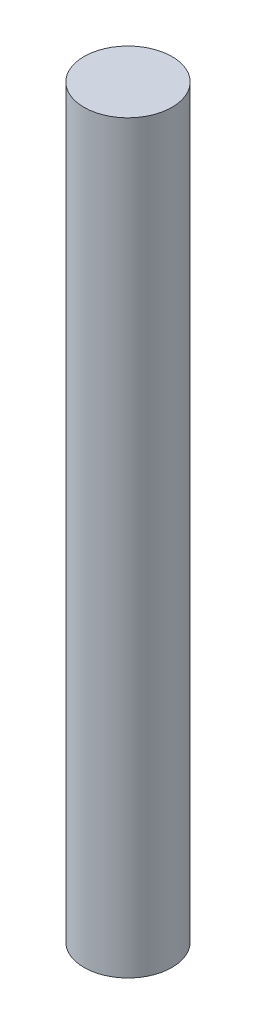
ISO-10303-21;
HEADER;
FILE_DESCRIPTION(('STEP AP214'),'2;1');
FILE_NAME('part.step','',(''),(''),'','','');
FILE_SCHEMA(('AUTOMOTIVE_DESIGN { 1 0 10303 214 1 1 1 1 }'));
ENDSEC;
DATA;
#1=APPLICATION_CONTEXT('core data for automotive mechanical design processes');
#2=APPLICATION_PROTOCOL_DEFINITION('international standard','automotive_design',2000,#1);
#3=PRODUCT_CONTEXT('',#1,'mechanical');
#4=PRODUCT('Part','Part','',(#3));
#5=PRODUCT_RELATED_PRODUCT_CATEGORY('part','',(#4));
#6=PRODUCT_DEFINITION_FORMATION('','',#4);
#7=PRODUCT_DEFINITION_CONTEXT('part definition',#1,'design');
#8=PRODUCT_DEFINITION('design','',#6,#7);
#9=PRODUCT_DEFINITION_SHAPE('','',#8);
#10=(LENGTH_UNIT() NAMED_UNIT(*) SI_UNIT(.MILLI.,.METRE.));
#11=(NAMED_UNIT(*) PLANE_ANGLE_UNIT() SI_UNIT($,.RADIAN.));
#12=(NAMED_UNIT(*) SI_UNIT($,.STERADIAN.) SOLID_ANGLE_UNIT());
#13=UNCERTAINTY_MEASURE_WITH_UNIT(LENGTH_MEASURE(1.E-05),#10,'distance_accuracy_value','');
#14=(GEOMETRIC_REPRESENTATION_CONTEXT(3) GLOBAL_UNCERTAINTY_ASSIGNED_CONTEXT((#13)) GLOBAL_UNIT_ASSIGNED_CONTEXT((#10,
#11,#12)) REPRESENTATION_CONTEXT('',''));
#15=CARTESIAN_POINT('',(0.,0.,0.));
#16=DIRECTION('',(0.,0.,1.));
#17=DIRECTION('',(1.,0.,0.));
#18=AXIS2_PLACEMENT_3D('',#15,#16,#17);
#19=CARTESIAN_POINT('',(0.,25.4,0.));
#20=DIRECTION('',(0.,-1.,0.));
#21=DIRECTION('',(0.,0.,-1.));
#22=AXIS2_PLACEMENT_3D('',#19,#20,#21);
#23=CYLINDRICAL_SURFACE('',#22,3.);
#24=CARTESIAN_POINT('',(0.,25.4,0.));
#25=DIRECTION('',(0.,1.,0.));
#26=DIRECTION('',(0.,0.,1.));
#27=AXIS2_PLACEMENT_3D('',#24,#25,#26);
#28=CIRCLE('',#27,3.);
#29=CARTESIAN_POINT('',(0.,25.4,3.));
#30=VERTEX_POINT('',#29);
#31=EDGE_CURVE('E10',#30,#30,#28,.T.);
#32=ORIENTED_EDGE('',*,*,#31,.F.);
#33=EDGE_LOOP('',(#32));
#34=FACE_BOUND('',#33,.T.);
#35=CARTESIAN_POINT('',(0.,-25.4,0.));
#36=DIRECTION('',(0.,1.,0.));
#37=DIRECTION('',(0.,0.,1.));
#38=AXIS2_PLACEMENT_3D('',#35,#36,#37);
#39=CIRCLE('',#38,3.);
#40=CARTESIAN_POINT('',(0.,-25.4,3.));
#41=VERTEX_POINT('',#40);
#42=EDGE_CURVE('E33',#41,#41,#39,.T.);
#43=ORIENTED_EDGE('',*,*,#42,.T.);
#44=EDGE_LOOP('',(#43));
#45=FACE_BOUND('',#44,.T.);
#46=ADVANCED_FACE('F30',(#34,#45),#23,.T.);
#47=CARTESIAN_POINT('',(0.,25.4,0.));
#48=DIRECTION('',(0.,1.,0.));
#49=DIRECTION('',(0.,0.,1.));
#50=AXIS2_PLACEMENT_3D('',#47,#48,#49);
#51=PLANE('',#50);
#52=ORIENTED_EDGE('',*,*,#31,.T.);
#53=EDGE_LOOP('',(#52));
#54=FACE_BOUND('',#53,.T.);
#55=ADVANCED_FACE('F45',(#54),#51,.T.);
#56=CARTESIAN_POINT('',(0.,-25.4,0.));
#57=DIRECTION('',(0.,1.,0.));
#58=DIRECTION('',(0.,0.,1.));
#59=AXIS2_PLACEMENT_3D('',#56,#57,#58);
#60=PLANE('',#59);
#61=ORIENTED_EDGE('',*,*,#42,.F.);
#62=EDGE_LOOP('',(#61));
#63=FACE_BOUND('',#62,.T.);
#64=ADVANCED_FACE('F43',(#63),#60,.F.);
#65=CLOSED_SHELL('',(#46,#55,#64));
#66=MANIFOLD_SOLID_BREP('B2',#65);
#67=ADVANCED_BREP_SHAPE_REPRESENTATION('',(#18,#66),#14);
#68=SHAPE_DEFINITION_REPRESENTATION(#9,#67);
ENDSEC;
END-ISO-10303-21;
